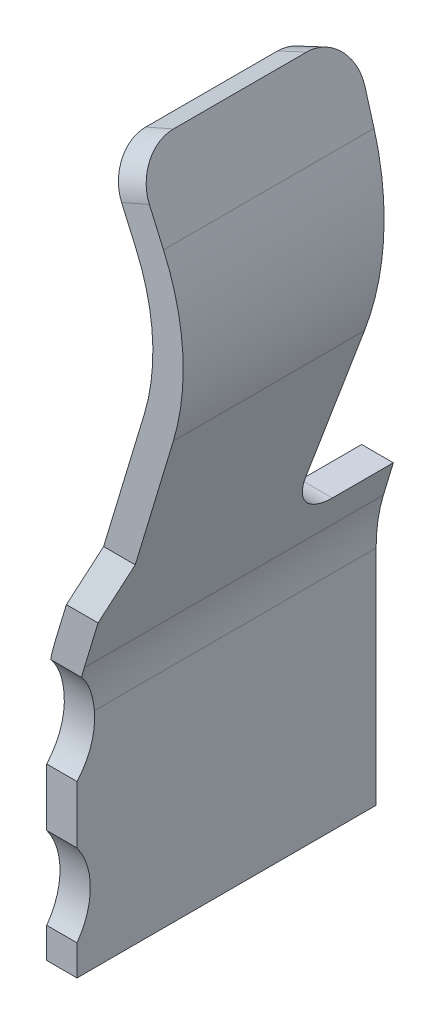
ISO-10303-21;
HEADER;
FILE_DESCRIPTION(('STEP AP214'),'2;1');
FILE_NAME('part.step','',(''),(''),'','','');
FILE_SCHEMA(('AUTOMOTIVE_DESIGN { 1 0 10303 214 1 1 1 1 }'));
ENDSEC;
DATA;
#1=APPLICATION_CONTEXT('core data for automotive mechanical design processes');
#2=APPLICATION_PROTOCOL_DEFINITION('international standard','automotive_design',2000,#1);
#3=PRODUCT_CONTEXT('',#1,'mechanical');
#4=PRODUCT('Part','Part','',(#3));
#5=PRODUCT_RELATED_PRODUCT_CATEGORY('part','',(#4));
#6=PRODUCT_DEFINITION_FORMATION('','',#4);
#7=PRODUCT_DEFINITION_CONTEXT('part definition',#1,'design');
#8=PRODUCT_DEFINITION('design','',#6,#7);
#9=PRODUCT_DEFINITION_SHAPE('','',#8);
#10=(LENGTH_UNIT() NAMED_UNIT(*) SI_UNIT(.MILLI.,.METRE.));
#11=(NAMED_UNIT(*) PLANE_ANGLE_UNIT() SI_UNIT($,.RADIAN.));
#12=(NAMED_UNIT(*) SI_UNIT($,.STERADIAN.) SOLID_ANGLE_UNIT());
#13=UNCERTAINTY_MEASURE_WITH_UNIT(LENGTH_MEASURE(1.E-05),#10,'distance_accuracy_value','');
#14=(GEOMETRIC_REPRESENTATION_CONTEXT(3) GLOBAL_UNCERTAINTY_ASSIGNED_CONTEXT((#13)) GLOBAL_UNIT_ASSIGNED_CONTEXT((#10,
#11,#12)) REPRESENTATION_CONTEXT('',''));
#15=CARTESIAN_POINT('',(0.,0.,0.));
#16=DIRECTION('',(0.,0.,1.));
#17=DIRECTION('',(1.,0.,0.));
#18=AXIS2_PLACEMENT_3D('',#15,#16,#17);
#19=CARTESIAN_POINT('',(-12.01613725867,3.53312166947706,-0.236832722369338));
#20=DIRECTION('',(-0.914255270392897,-0.402239697454475,0.0483789866630426));
#21=DIRECTION('',(0.402711251685505,-0.915327071470026,0.));
#22=AXIS2_PLACEMENT_3D('',#19,#20,#21);
#23=CYLINDRICAL_SURFACE('',#22,0.2);
#24=CARTESIAN_POINT('',(-12.0296414773253,3.50329761180303,-0.434687053017797));
#25=CARTESIAN_POINT('',(-12.0807184044719,3.6193909515076,-0.448650066039084));
#26=CARTESIAN_POINT('',(-12.1189871835182,3.70637250294574,-0.363398989614743));
#27=CARTESIAN_POINT('',(-12.1189871835182,3.70637250294574,-0.235652283248446));
#28=(BOUNDED_CURVE() B_SPLINE_CURVE(3,(#24,#25,#26,#27),.UNSPECIFIED.,.F.,
.F.) B_SPLINE_CURVE_WITH_KNOTS((4,4),(3.0320715031167,4.71238898038462),
.UNSPECIFIED.) CURVE() GEOMETRIC_REPRESENTATION_ITEM() RATIONAL_B_SPLINE_CURVE((1.,
0.778229742533871,0.778229742533871,1.)) REPRESENTATION_ITEM(''));
#29=CARTESIAN_POINT('',(-12.0296414773253,3.50329761180303,-0.434687053017797));
#30=VERTEX_POINT('',#29);
#31=CARTESIAN_POINT('',(-12.1189871835182,3.70637250294574,-0.235652283248446));
#32=VERTEX_POINT('',#31);
#33=EDGE_CURVE('E498',#30,#32,#28,.T.);
#34=ORIENTED_EDGE('',*,*,#33,.F.);
#35=DIRECTION('',(0.914255270392898,0.402239697454473,-0.0483789866630426));
#36=VECTOR('',#35,1.);
#37=CARTESIAN_POINT('',(-36.077177596038,-7.07676024092296,0.837819069551529));
#38=LINE('',#37,#36);
#39=CARTESIAN_POINT('',(-12.1669405380458,3.44289092405021,-0.427421697659669));
#40=VERTEX_POINT('',#39);
#41=EDGE_CURVE('E11',#40,#30,#38,.T.);
#42=ORIENTED_EDGE('',*,*,#41,.F.);
#43=CARTESIAN_POINT('',(-12.2562862442387,3.64596581519291,-0.228386927890318));
#44=CARTESIAN_POINT('',(-12.2562862442387,3.64596581519291,-0.356133634256616));
#45=CARTESIAN_POINT('',(-12.2180174651924,3.55898426375477,-0.441384710680957));
#46=CARTESIAN_POINT('',(-12.1669405380458,3.44289092405021,-0.427421697659669));
#47=(BOUNDED_CURVE() B_SPLINE_CURVE(3,(#43,#44,#45,#46),.UNSPECIFIED.,.F.,
.F.) B_SPLINE_CURVE_WITH_KNOTS((4,4),(1.57079632679495,3.25111380406287),
.UNSPECIFIED.) CURVE() GEOMETRIC_REPRESENTATION_ITEM() RATIONAL_B_SPLINE_CURVE((1.,
0.778229742533869,0.778229742533869,1.)) REPRESENTATION_ITEM(''));
#48=CARTESIAN_POINT('',(-12.2562862442387,3.64596581519291,-0.228386927890318));
#49=VERTEX_POINT('',#48);
#50=EDGE_CURVE('E488',#49,#40,#47,.T.);
#51=ORIENTED_EDGE('',*,*,#50,.F.);
#52=DIRECTION('',(-0.914255270392898,-0.402239697454473,0.0483789866630426));
#53=VECTOR('',#52,1.);
#54=CARTESIAN_POINT('',(-12.0966795090071,3.71618708377106,-0.236832722369339));
#55=LINE('',#54,#53);
#56=EDGE_CURVE('E522',#32,#49,#55,.T.);
#57=ORIENTED_EDGE('',*,*,#56,.F.);
#58=EDGE_LOOP('',(#34,#42,#51,#57));
#59=FACE_BOUND('',#58,.T.);
#60=ADVANCED_FACE('F16',(#59),#23,.T.);
#61=CARTESIAN_POINT('',(-12.0384449331811,3.52330708865174,0.423604352914838));
#62=DIRECTION('',(0.915327071470026,0.402711251685505,0.));
#63=DIRECTION('',(-0.402711251685505,0.915327071470026,0.));
#64=AXIS2_PLACEMENT_3D('',#61,#62,#63);
#65=CYLINDRICAL_SURFACE('',#64,0.2);
#66=CARTESIAN_POINT('',(-12.1757439939016,3.46290040089891,0.423604352914837));
#67=DIRECTION('',(-0.915327071470029,-0.402711251685498,0.));
#68=DIRECTION('',(-0.402711251685498,0.915327071470029,0.));
#69=AXIS2_PLACEMENT_3D('',#66,#67,#68);
#70=CIRCLE('',#69,0.2);
#71=CARTESIAN_POINT('',(-12.1757439939016,3.46290040089891,0.623604352914837));
#72=VERTEX_POINT('',#71);
#73=CARTESIAN_POINT('',(-12.2562862442387,3.64596581519291,0.423604352914837));
#74=VERTEX_POINT('',#73);
#75=EDGE_CURVE('E441',#72,#74,#70,.T.);
#76=ORIENTED_EDGE('',*,*,#75,.F.);
#77=DIRECTION('',(-0.915327071470027,-0.402711251685503,0.));
#78=VECTOR('',#77,1.);
#79=CARTESIAN_POINT('',(-36.7930633966531,-7.36784176638169,0.623604352914803));
#80=LINE('',#79,#78);
#81=CARTESIAN_POINT('',(-12.0384449331811,3.52330708865174,0.623604352914837));
#82=VERTEX_POINT('',#81);
#83=EDGE_CURVE('E27',#82,#72,#80,.T.);
#84=ORIENTED_EDGE('',*,*,#83,.F.);
#85=CARTESIAN_POINT('',(-12.0384449331811,3.52330708865174,0.423604352914838));
#86=DIRECTION('',(0.915327071470029,0.402711251685498,0.));
#87=DIRECTION('',(0.402711251685498,-0.915327071470029,0.));
#88=AXIS2_PLACEMENT_3D('',#85,#86,#87);
#89=CIRCLE('',#88,0.2);
#90=CARTESIAN_POINT('',(-12.1189871835182,3.70637250294574,0.423604352914837));
#91=VERTEX_POINT('',#90);
#92=EDGE_CURVE('E544',#91,#82,#89,.T.);
#93=ORIENTED_EDGE('',*,*,#92,.F.);
#94=DIRECTION('',(0.915327071470027,0.402711251685503,0.));
#95=VECTOR('',#94,1.);
#96=CARTESIAN_POINT('',(-12.1189871835182,3.70637250294574,0.423604352914837));
#97=LINE('',#96,#95);
#98=EDGE_CURVE('E516',#74,#91,#97,.T.);
#99=ORIENTED_EDGE('',*,*,#98,.F.);
#100=EDGE_LOOP('',(#76,#84,#93,#99));
#101=FACE_BOUND('',#100,.T.);
#102=ADVANCED_FACE('F301',(#101),#65,.T.);
#103=CARTESIAN_POINT('',(-40.89,1.65634067151207,-0.212546111318104));
#104=DIRECTION('',(0.,-1.,0.));
#105=DIRECTION('',(0.,0.,-1.));
#106=AXIS2_PLACEMENT_3D('',#103,#104,#105);
#107=PLANE('',#106);
#108=DIRECTION('',(0.,0.,-1.));
#109=VECTOR('',#108,1.);
#110=CARTESIAN_POINT('',(-12.3515034091056,1.65634067151207,-0.740000000000021));
#111=LINE('',#110,#109);
#112=CARTESIAN_POINT('',(-12.3515034091056,1.65634067151207,-0.438042305987955));
#113=VERTEX_POINT('',#112);
#114=CARTESIAN_POINT('',(-12.3515034091056,1.65634067151207,-0.740000000000021));
#115=VERTEX_POINT('',#114);
#116=EDGE_CURVE('E556',#113,#115,#111,.T.);
#117=ORIENTED_EDGE('',*,*,#116,.F.);
#118=DIRECTION('',(1.,0.,0.));
#119=VECTOR('',#118,1.);
#120=CARTESIAN_POINT('',(-12.1948350789415,1.65634067151207,-0.438042305987954));
#121=LINE('',#120,#119);
#122=CARTESIAN_POINT('',(-12.1948350789415,1.65634067151207,-0.438042305987954));
#123=VERTEX_POINT('',#122);
#124=EDGE_CURVE('E514',#113,#123,#121,.T.);
#125=ORIENTED_EDGE('',*,*,#124,.T.);
#126=DIRECTION('',(0.,0.,1.));
#127=VECTOR('',#126,1.);
#128=CARTESIAN_POINT('',(-12.1948350789415,1.65634067151207,-0.74000000000002));
#129=LINE('',#128,#127);
#130=CARTESIAN_POINT('',(-12.1948350789415,1.65634067151207,-0.74000000000002));
#131=VERTEX_POINT('',#130);
#132=EDGE_CURVE('E480',#131,#123,#129,.T.);
#133=ORIENTED_EDGE('',*,*,#132,.F.);
#134=DIRECTION('',(-1.,0.,0.));
#135=VECTOR('',#134,1.);
#136=CARTESIAN_POINT('',(-11.43,1.65634067151207,-0.740000000000019));
#137=LINE('',#136,#135);
#138=EDGE_CURVE('E545',#131,#115,#137,.T.);
#139=ORIENTED_EDGE('',*,*,#138,.T.);
#140=EDGE_LOOP('',(#117,#125,#133,#139));
#141=FACE_BOUND('',#140,.T.);
#142=ADVANCED_FACE('F299',(#141),#107,.F.);
#143=CARTESIAN_POINT('',(-40.89,3.70637250294571,-0.459111687165995));
#144=DIRECTION('',(0.,0.119413416546905,0.992844618230162));
#145=DIRECTION('',(1.,0.,0.));
#146=AXIS2_PLACEMENT_3D('',#143,#144,#145);
#147=PLANE('',#146);
#148=DIRECTION('',(0.286748539926818,0.951150986717315,-0.11439875574724));
#149=VECTOR('',#148,1.);
#150=CARTESIAN_POINT('',(-12.2258776351119,1.55337185451571,-0.200161637444148));
#151=LINE('',#150,#149);
#152=CARTESIAN_POINT('',(-12.1273399772696,1.88022335482146,-0.239473382341922));
#153=VERTEX_POINT('',#152);
#154=CARTESIAN_POINT('',(-11.9197982395462,2.56864369924933,-0.322272466749581));
#155=VERTEX_POINT('',#154);
#156=EDGE_CURVE('E490',#153,#155,#151,.T.);
#157=ORIENTED_EDGE('',*,*,#156,.F.);
#158=DIRECTION('',(-1.,0.,0.));
#159=VECTOR('',#158,1.);
#160=CARTESIAN_POINT('',(-12.3515034091056,1.88022335482146,-0.239473382341922));
#161=LINE('',#160,#159);
#162=CARTESIAN_POINT('',(-12.2840083074336,1.88022335482146,-0.239473382341922));
#163=VERTEX_POINT('',#162);
#164=EDGE_CURVE('E376',#153,#163,#161,.T.);
#165=ORIENTED_EDGE('',*,*,#164,.T.);
#166=DIRECTION('',(-0.28674853992682,-0.951150986717314,0.11439875574724));
#167=VECTOR('',#166,1.);
#168=CARTESIAN_POINT('',(-12.3696639548885,1.59610175610151,-0.205300934614505));
#169=LINE('',#168,#167);
#170=CARTESIAN_POINT('',(-12.0634137359037,2.61194022573825,-0.327479914176623));
#171=VERTEX_POINT('',#170);
#172=EDGE_CURVE('E560',#171,#163,#169,.T.);
#173=ORIENTED_EDGE('',*,*,#172,.F.);
#174=CARTESIAN_POINT('',(-12.1055233068166,3.30329498734983,-0.410631932744419));
#175=CARTESIAN_POINT('',(-12.0085450102924,3.08287189317973,-0.384120760424612));
#176=CARTESIAN_POINT('',(-11.9939044888234,2.84250387207174,-0.355210731501567));
#177=CARTESIAN_POINT('',(-12.0634137359037,2.61194022573825,-0.327479914176623));
#178=(BOUNDED_CURVE() B_SPLINE_CURVE(3,(#174,#175,#176,#177),.UNSPECIFIED.,.F.,
.F.) B_SPLINE_CURVE_WITH_KNOTS((4,4),(4.29791199977039,5.00519872138853),
.UNSPECIFIED.) CURVE() GEOMETRIC_REPRESENTATION_ITEM() RATIONAL_B_SPLINE_CURVE((1.,
0.958744787021091,0.958744787021091,1.)) REPRESENTATION_ITEM(''));
#179=CARTESIAN_POINT('',(-12.1055233068166,3.30329498734983,-0.410631932744419));
#180=VERTEX_POINT('',#179);
#181=EDGE_CURVE('E443',#180,#171,#178,.T.);
#182=ORIENTED_EDGE('',*,*,#181,.F.);
#183=DIRECTION('',(0.400292818236851,-0.909830186054405,0.109428936813833));
#184=VECTOR('',#183,1.);
#185=CARTESIAN_POINT('',(-12.1199508196559,3.33608744850051,-0.414576013974334));
#186=LINE('',#185,#184);
#187=EDGE_CURVE('E486',#40,#180,#186,.T.);
#188=ORIENTED_EDGE('',*,*,#187,.F.);
#189=ORIENTED_EDGE('',*,*,#41,.T.);
#190=DIRECTION('',(-0.40029281823685,0.909830186054405,-0.109428936813833));
#191=VECTOR('',#190,1.);
#192=CARTESIAN_POINT('',(-11.9823335100882,3.39577078475993,-0.421754368938235));
#193=LINE('',#192,#191);
#194=CARTESIAN_POINT('',(-11.9682242460961,3.36370167510267,-0.417897288102547));
#195=VERTEX_POINT('',#194);
#196=EDGE_CURVE('E505',#195,#30,#193,.T.);
#197=ORIENTED_EDGE('',*,*,#196,.F.);
#198=CARTESIAN_POINT('',(-11.9197982395462,2.56864369924933,-0.322272466749581));
#199=CARTESIAN_POINT('',(-11.839862605404,2.83379189253285,-0.354162906673267));
#200=CARTESIAN_POINT('',(-11.8566992050933,3.11021511680704,-0.387409439934769));
#201=CARTESIAN_POINT('',(-11.9682242460961,3.36370167510267,-0.417897288102547));
#202=(BOUNDED_CURVE() B_SPLINE_CURVE(3,(#198,#199,#200,#201),.UNSPECIFIED.,.F.,
.F.) B_SPLINE_CURVE_WITH_KNOTS((4,4),(1.27798658579106,1.98527330740919),
.UNSPECIFIED.) CURVE() GEOMETRIC_REPRESENTATION_ITEM() RATIONAL_B_SPLINE_CURVE((1.,
0.958744787021091,0.958744787021091,1.)) REPRESENTATION_ITEM(''));
#203=EDGE_CURVE('E266',#155,#195,#202,.T.);
#204=ORIENTED_EDGE('',*,*,#203,.F.);
#205=EDGE_LOOP('',(#157,#165,#173,#182,#188,#189,#197,#204));
#206=FACE_BOUND('',#205,.T.);
#207=ADVANCED_FACE('F351',(#206),#147,.F.);
#208=CARTESIAN_POINT('',(-40.89,1.94413292378283,0.623604352914797));
#209=DIRECTION('',(0.,0.,-1.));
#210=DIRECTION('',(0.,-1.,0.));
#211=AXIS2_PLACEMENT_3D('',#208,#209,#210);
#212=PLANE('',#211);
#213=DIRECTION('',(0.4027112516855,-0.915327071470028,0.));
#214=VECTOR('',#213,1.);
#215=CARTESIAN_POINT('',(-11.9682242460961,3.36370167510267,0.623604352914838));
#216=LINE('',#215,#214);
#217=CARTESIAN_POINT('',(-11.9682242460961,3.36370167510267,0.623604352914838));
#218=VERTEX_POINT('',#217);
#219=EDGE_CURVE('E541',#82,#218,#216,.T.);
#220=ORIENTED_EDGE('',*,*,#219,.F.);
#221=ORIENTED_EDGE('',*,*,#83,.T.);
#222=DIRECTION('',(-0.402711251685501,0.915327071470028,0.));
#223=VECTOR('',#222,1.);
#224=CARTESIAN_POINT('',(-12.1055233068166,3.30329498734984,0.623604352914837));
#225=LINE('',#224,#223);
#226=CARTESIAN_POINT('',(-12.1055233068166,3.30329498734983,0.623604352914837));
#227=VERTEX_POINT('',#226);
#228=EDGE_CURVE('E536',#227,#72,#225,.T.);
#229=ORIENTED_EDGE('',*,*,#228,.F.);
#230=CARTESIAN_POINT('',(-13.0208503782866,2.90058373566433,0.623604352914836));
#231=DIRECTION('',(0.,0.,1.));
#232=DIRECTION('',(-1.,0.,0.));
#233=AXIS2_PLACEMENT_3D('',#230,#231,#232);
#234=CIRCLE('',#233,1.);
#235=CARTESIAN_POINT('',(-12.0634137359037,2.61194022573825,0.623604352914837));
#236=VERTEX_POINT('',#235);
#237=EDGE_CURVE('E539',#236,#227,#234,.T.);
#238=ORIENTED_EDGE('',*,*,#237,.F.);
#239=DIRECTION('',(0.28864350992609,0.957436642382956,0.));
#240=VECTOR('',#239,1.);
#241=CARTESIAN_POINT('',(-12.387436642383,1.53714937485737,0.623604352914836));
#242=LINE('',#241,#240);
#243=CARTESIAN_POINT('',(-12.2647411502284,1.94413292378283,0.623604352914837));
#244=VERTEX_POINT('',#243);
#245=EDGE_CURVE('E368',#244,#236,#242,.T.);
#246=ORIENTED_EDGE('',*,*,#245,.F.);
#247=DIRECTION('',(1.,0.,0.));
#248=VECTOR('',#247,1.);
#249=CARTESIAN_POINT('',(-40.89,1.94413292378283,0.623604352914797));
#250=LINE('',#249,#248);
#251=CARTESIAN_POINT('',(-12.1080728200643,1.94413292378283,0.623604352914837));
#252=VERTEX_POINT('',#251);
#253=EDGE_CURVE('E454',#244,#252,#250,.T.);
#254=ORIENTED_EDGE('',*,*,#253,.T.);
#255=DIRECTION('',(-0.288643509926088,-0.957436642382956,0.));
#256=VECTOR('',#255,1.);
#257=CARTESIAN_POINT('',(-12.2438211460255,1.49385284836845,0.623604352914837));
#258=LINE('',#257,#256);
#259=CARTESIAN_POINT('',(-11.9197982395462,2.56864369924933,0.623604352914837));
#260=VERTEX_POINT('',#259);
#261=EDGE_CURVE('E532',#260,#252,#258,.T.);
#262=ORIENTED_EDGE('',*,*,#261,.F.);
#263=CARTESIAN_POINT('',(-13.0208503782866,2.90058373566433,0.623604352914836));
#264=DIRECTION('',(0.,0.,-1.));
#265=DIRECTION('',(-1.,0.,0.));
#266=AXIS2_PLACEMENT_3D('',#263,#264,#265);
#267=CIRCLE('',#266,1.15);
#268=EDGE_CURVE('E575',#218,#260,#267,.T.);
#269=ORIENTED_EDGE('',*,*,#268,.F.);
#270=EDGE_LOOP('',(#220,#221,#229,#238,#246,#254,#262,#269));
#271=FACE_BOUND('',#270,.T.);
#272=ADVANCED_FACE('F661',(#271),#212,.F.);
#273=CARTESIAN_POINT('',(-40.89,1.7003498353216,0.749999999999972));
#274=DIRECTION('',(0.,-0.460287319631494,-0.887770005906065));
#275=DIRECTION('',(0.,-0.887770005906065,0.460287319631494));
#276=AXIS2_PLACEMENT_3D('',#273,#274,#275);
#277=PLANE('',#276);
#278=ORIENTED_EDGE('',*,*,#253,.F.);
#279=DIRECTION('',(0.258541028225373,0.857586072334425,-0.444637678635293));
#280=VECTOR('',#279,1.);
#281=CARTESIAN_POINT('',(-12.2064234383064,2.13757401070795,0.523309818502746));
#282=LINE('',#281,#280);
#283=CARTESIAN_POINT('',(-12.3324210876793,1.7196371362757,0.73999999999998));
#284=VERTEX_POINT('',#283);
#285=EDGE_CURVE('E482',#284,#244,#282,.T.);
#286=ORIENTED_EDGE('',*,*,#285,.F.);
#287=DIRECTION('',(-1.,0.,0.));
#288=VECTOR('',#287,1.);
#289=CARTESIAN_POINT('',(-11.43,1.7196371362757,0.739999999999981));
#290=LINE('',#289,#288);
#291=CARTESIAN_POINT('',(-12.1757527575152,1.7196371362757,0.73999999999998));
#292=VERTEX_POINT('',#291);
#293=EDGE_CURVE('E525',#292,#284,#290,.T.);
#294=ORIENTED_EDGE('',*,*,#293,.F.);
#295=DIRECTION('',(-0.258541028225372,-0.857586072334425,0.444637678635293));
#296=VECTOR('',#295,1.);
#297=CARTESIAN_POINT('',(-12.0602273619162,2.10283732290249,0.541319952677682));
#298=LINE('',#297,#296);
#299=EDGE_CURVE('E272',#252,#292,#298,.T.);
#300=ORIENTED_EDGE('',*,*,#299,.F.);
#301=EDGE_LOOP('',(#278,#286,#294,#300));
#302=FACE_BOUND('',#301,.T.);
#303=ADVANCED_FACE('F653',(#302),#277,.F.);
#304=CARTESIAN_POINT('',(-11.43,1.24850586493128,0.739999999999981));
#305=DIRECTION('',(0.,0.,-1.));
#306=DIRECTION('',(0.,-1.,0.));
#307=AXIS2_PLACEMENT_3D('',#304,#305,#306);
#308=PLANE('',#307);
#309=DIRECTION('',(0.,1.,0.));
#310=VECTOR('',#309,1.);
#311=CARTESIAN_POINT('',(-12.28,0.145965815192914,0.73999999999998));
#312=LINE('',#311,#310);
#313=CARTESIAN_POINT('',(-12.28,0.145965815192914,0.73999999999998));
#314=VERTEX_POINT('',#313);
#315=CARTESIAN_POINT('',(-12.28,0.296740599868486,0.73999999999998));
#316=VERTEX_POINT('',#315);
#317=EDGE_CURVE('E414',#314,#316,#312,.T.);
#318=ORIENTED_EDGE('',*,*,#317,.T.);
#319=DIRECTION('',(-1.,0.,0.));
#320=VECTOR('',#319,1.);
#321=CARTESIAN_POINT('',(-40.89,0.296740599868486,0.73999999999994));
#322=LINE('',#321,#320);
#323=CARTESIAN_POINT('',(-12.43,0.296740599868486,0.739999999999979));
#324=VERTEX_POINT('',#323);
#325=EDGE_CURVE('E253',#316,#324,#322,.T.);
#326=ORIENTED_EDGE('',*,*,#325,.T.);
#327=DIRECTION('',(0.,-1.,0.));
#328=VECTOR('',#327,1.);
#329=CARTESIAN_POINT('',(-12.43,0.145965815192914,0.739999999999979));
#330=LINE('',#329,#328);
#331=CARTESIAN_POINT('',(-12.43,0.145965815192914,0.739999999999979));
#332=VERTEX_POINT('',#331);
#333=EDGE_CURVE('E548',#324,#332,#330,.T.);
#334=ORIENTED_EDGE('',*,*,#333,.T.);
#335=DIRECTION('',(1.,0.,0.));
#336=VECTOR('',#335,1.);
#337=CARTESIAN_POINT('',(-12.28,0.145965815192914,0.73999999999998));
#338=LINE('',#337,#336);
#339=EDGE_CURVE('E457',#332,#314,#338,.T.);
#340=ORIENTED_EDGE('',*,*,#339,.T.);
#341=EDGE_LOOP('',(#318,#326,#334,#340));
#342=FACE_BOUND('',#341,.T.);
#343=ADVANCED_FACE('F651',(#342),#308,.F.);
#344=CARTESIAN_POINT('',(-11.43,1.24850586493128,-0.740000000000019));
#345=DIRECTION('',(0.,0.,-1.));
#346=DIRECTION('',(0.,-1.,0.));
#347=AXIS2_PLACEMENT_3D('',#344,#345,#346);
#348=PLANE('',#347);
#349=ORIENTED_EDGE('',*,*,#138,.F.);
#350=DIRECTION('',(0.288643509926088,0.957436642382956,0.));
#351=VECTOR('',#350,1.);
#352=CARTESIAN_POINT('',(-12.2438211460255,1.49385284836845,-0.74000000000002));
#353=LINE('',#352,#351);
#354=CARTESIAN_POINT('',(-12.2438211460255,1.49385284836845,-0.74000000000002));
#355=VERTEX_POINT('',#354);
#356=EDGE_CURVE('E477',#355,#131,#353,.T.);
#357=ORIENTED_EDGE('',*,*,#356,.F.);
#358=CARTESIAN_POINT('',(-11.43,1.24850586493128,-0.740000000000019));
#359=DIRECTION('',(0.,0.,-1.));
#360=DIRECTION('',(1.,0.,0.));
#361=AXIS2_PLACEMENT_3D('',#358,#359,#360);
#362=CIRCLE('',#361,0.85);
#363=CARTESIAN_POINT('',(-12.28,1.24850586493128,-0.74000000000002));
#364=VERTEX_POINT('',#363);
#365=EDGE_CURVE('E497',#364,#355,#362,.T.);
#366=ORIENTED_EDGE('',*,*,#365,.F.);
#367=DIRECTION('',(0.,1.,0.));
#368=VECTOR('',#367,1.);
#369=CARTESIAN_POINT('',(-12.28,0.145965815192914,-0.74000000000002));
#370=LINE('',#369,#368);
#371=CARTESIAN_POINT('',(-12.28,0.145965815192914,-0.74000000000002));
#372=VERTEX_POINT('',#371);
#373=EDGE_CURVE('E422',#372,#364,#370,.T.);
#374=ORIENTED_EDGE('',*,*,#373,.F.);
#375=DIRECTION('',(1.,0.,0.));
#376=VECTOR('',#375,1.);
#377=CARTESIAN_POINT('',(-12.28,0.145965815192914,-0.74000000000002));
#378=LINE('',#377,#376);
#379=CARTESIAN_POINT('',(-12.43,0.145965815192914,-0.740000000000021));
#380=VERTEX_POINT('',#379);
#381=EDGE_CURVE('E426',#380,#372,#378,.T.);
#382=ORIENTED_EDGE('',*,*,#381,.F.);
#383=DIRECTION('',(0.,-1.,0.));
#384=VECTOR('',#383,1.);
#385=CARTESIAN_POINT('',(-12.43,0.145965815192914,-0.740000000000021));
#386=LINE('',#385,#384);
#387=CARTESIAN_POINT('',(-12.43,1.24850586493128,-0.740000000000021));
#388=VERTEX_POINT('',#387);
#389=EDGE_CURVE('E42',#388,#380,#386,.T.);
#390=ORIENTED_EDGE('',*,*,#389,.F.);
#391=CARTESIAN_POINT('',(-11.43,1.24850586493128,-0.740000000000019));
#392=DIRECTION('',(0.,0.,1.));
#393=DIRECTION('',(1.,0.,0.));
#394=AXIS2_PLACEMENT_3D('',#391,#392,#393);
#395=CIRCLE('',#394,1.);
#396=CARTESIAN_POINT('',(-12.387436642383,1.53714937485737,-0.740000000000021));
#397=VERTEX_POINT('',#396);
#398=EDGE_CURVE('E367',#397,#388,#395,.T.);
#399=ORIENTED_EDGE('',*,*,#398,.F.);
#400=DIRECTION('',(-0.28864350992609,-0.957436642382956,0.));
#401=VECTOR('',#400,1.);
#402=CARTESIAN_POINT('',(-12.387436642383,1.53714937485737,-0.740000000000021));
#403=LINE('',#402,#401);
#404=EDGE_CURVE('E559',#115,#397,#403,.T.);
#405=ORIENTED_EDGE('',*,*,#404,.F.);
#406=EDGE_LOOP('',(#349,#357,#366,#374,#382,#390,#399,#405));
#407=FACE_BOUND('',#406,.T.);
#408=ADVANCED_FACE('F650',(#407),#348,.T.);
#409=CARTESIAN_POINT('',(-12.43,0.145965815192914,-0.740000000000021));
#410=DIRECTION('',(1.,0.,0.));
#411=DIRECTION('',(0.,1.,0.));
#412=AXIS2_PLACEMENT_3D('',#409,#410,#411);
#413=PLANE('',#412);
#414=DIRECTION('',(0.,-1.,0.));
#415=VECTOR('',#414,1.);
#416=CARTESIAN_POINT('',(-12.43,0.145965815192914,0.739999999999979));
#417=LINE('',#416,#415);
#418=CARTESIAN_POINT('',(-12.43,0.988055123608201,0.739999999999979));
#419=VERTEX_POINT('',#418);
#420=CARTESIAN_POINT('',(-12.43,0.703259400131467,0.739999999999979));
#421=VERTEX_POINT('',#420);
#422=EDGE_CURVE('E239',#419,#421,#417,.T.);
#423=ORIENTED_EDGE('',*,*,#422,.F.);
#424=CARTESIAN_POINT('',(-12.43,1.21669179396546,0.995153761033096));
#425=DIRECTION('',(1.,0.,0.));
#426=DIRECTION('',(0.,1.,0.));
#427=AXIS2_PLACEMENT_3D('',#424,#425,#426);
#428=CIRCLE('',#427,0.342604974863759);
#429=CARTESIAN_POINT('',(-12.43,1.24850586493128,0.654029100989324));
#430=VERTEX_POINT('',#429);
#431=EDGE_CURVE('E371',#419,#430,#428,.T.);
#432=ORIENTED_EDGE('',*,*,#431,.T.);
#433=DIRECTION('',(0.,0.,1.));
#434=VECTOR('',#433,1.);
#435=CARTESIAN_POINT('',(-12.43,1.24850586493128,-0.740000000000021));
#436=LINE('',#435,#434);
#437=EDGE_CURVE('E359',#388,#430,#436,.T.);
#438=ORIENTED_EDGE('',*,*,#437,.F.);
#439=ORIENTED_EDGE('',*,*,#389,.T.);
#440=DIRECTION('',(0.,0.,1.));
#441=VECTOR('',#440,1.);
#442=CARTESIAN_POINT('',(-12.43,0.145965815192914,-0.740000000000021));
#443=LINE('',#442,#441);
#444=EDGE_CURVE('E437',#380,#332,#443,.T.);
#445=ORIENTED_EDGE('',*,*,#444,.T.);
#446=ORIENTED_EDGE('',*,*,#333,.F.);
#447=CARTESIAN_POINT('',(-12.43,0.499999999999977,1.0194268345702));
#448=DIRECTION('',(1.,0.,0.));
#449=DIRECTION('',(0.,1.,0.));
#450=AXIS2_PLACEMENT_3D('',#447,#448,#449);
#451=CIRCLE('',#450,0.345533991988848);
#452=EDGE_CURVE('E261',#324,#421,#451,.T.);
#453=ORIENTED_EDGE('',*,*,#452,.T.);
#454=EDGE_LOOP('',(#423,#432,#438,#439,#445,#446,#453));
#455=FACE_BOUND('',#454,.T.);
#456=ADVANCED_FACE('F18',(#455),#413,.F.);
#457=CARTESIAN_POINT('',(-11.43,1.24850586493128,-0.740000000000019));
#458=DIRECTION('',(0.,0.,1.));
#459=DIRECTION('',(-1.,0.,0.));
#460=AXIS2_PLACEMENT_3D('',#457,#458,#459);
#461=CYLINDRICAL_SURFACE('',#460,1.);
#462=ORIENTED_EDGE('',*,*,#437,.T.);
#463=CARTESIAN_POINT('',(-12.43,1.24850586493127,0.654029100989324));
#464=CARTESIAN_POINT('',(-12.4300000740736,1.25306932177769,0.654454497923855));
#465=CARTESIAN_POINT('',(-12.4299687647214,1.25762446546754,0.654969794425812));
#466=CARTESIAN_POINT('',(-12.4298448349043,1.26669234380949,0.656178662703579));
#467=CARTESIAN_POINT('',(-12.429752450797,1.27120517419934,0.656871540938648));
#468=CARTESIAN_POINT('',(-12.4295080867067,1.28018764830172,0.658435530000208));
#469=CARTESIAN_POINT('',(-12.4293562428961,1.28465736695006,0.659306231418308));
#470=CARTESIAN_POINT('',(-12.428994777031,1.29355289226591,0.66122551469751));
#471=CARTESIAN_POINT('',(-12.428785194459,1.29797872680704,0.662273974817246));
#472=CARTESIAN_POINT('',(-12.428310027927,1.30678583476538,0.664548502475913));
#473=CARTESIAN_POINT('',(-12.4280443925259,1.31116706334832,0.665774732832877));
#474=CARTESIAN_POINT('',(-12.4274588915287,1.3198843749952,0.668404514864961));
#475=CARTESIAN_POINT('',(-12.4271388909945,1.32422031651455,0.669808505489047));
#476=CARTESIAN_POINT('',(-12.4264464106962,1.33284654509366,0.672793524574377));
#477=CARTESIAN_POINT('',(-12.426073721373,1.33713657245192,0.674375254537423));
#478=CARTESIAN_POINT('',(-12.4252776024185,1.3456704905919,0.677715533217602));
#479=CARTESIAN_POINT('',(-12.424853898673,1.34991398511775,0.679475028174317));
#480=CARTESIAN_POINT('',(-12.4239632184939,1.3583001952392,0.683146652073635));
#481=CARTESIAN_POINT('',(-12.4234965071955,1.36244335249474,0.685057836907787));
#482=CARTESIAN_POINT('',(-12.4225231286019,1.37063194178133,0.689033531510635));
#483=CARTESIAN_POINT('',(-12.4220166121165,1.3746776733672,0.691097460992988));
#484=CARTESIAN_POINT('',(-12.4209671316822,1.38267128376321,0.695378434356097));
#485=CARTESIAN_POINT('',(-12.4204242473525,1.38661935199285,0.697595144047742));
#486=CARTESIAN_POINT('',(-12.4193054429821,1.3944176464863,0.702181418875124));
#487=CARTESIAN_POINT('',(-12.4187295429942,1.39826793013338,0.704550891333563));
#488=CARTESIAN_POINT('',(-12.4175480296279,1.40587073759801,0.709442454925419));
#489=CARTESIAN_POINT('',(-12.4169423891827,1.40962316742021,0.711964685589659));
#490=CARTESIAN_POINT('',(-12.4157046207362,1.41703045047604,0.717161525964015));
#491=CARTESIAN_POINT('',(-12.4150724314729,1.42068504210867,0.71983649388048));
#492=CARTESIAN_POINT('',(-12.4137847065421,1.42789683764646,0.725338623348415));
#493=CARTESIAN_POINT('',(-12.4131290884706,1.43145359950904,0.728166344681736));
#494=CARTESIAN_POINT('',(-12.4117975159457,1.43847023753003,0.733973670299635));
#495=CARTESIAN_POINT('',(-12.4111214705009,1.44192948379841,0.736954014976292));
#496=CARTESIAN_POINT('',(-12.4104391181347,1.44532846432271,0.73999999999998));
#497=B_SPLINE_CURVE_WITH_KNOTS('',3,(#463,#464,#465,#466,#467,#468,#469,#470,#471,#472,#473,
#474,#475,#476,#477,#478,#479,#480,#481,#482,#483,#484,#485,#486,#487,#488,#489,#490,#491,#492,
#493,#494,#495,#496),.UNSPECIFIED.,.F.,.F.,(4,2,2,2,2,2,2,2,2,2,2,2,2,2,2,2,4),(0.,
0.0137488277368624,0.0274447569678338,0.0411095020482752,0.0547649260999381,0.0684329369758103,
0.0821353821583741,0.0958939450962579,0.109730045405106,0.123485924963603,0.13719199135644,
0.150868974600578,0.164537737054553,0.178219178701913,0.191934141579245,0.205703315520567,
0.219547147320745),.UNSPECIFIED.);
#498=CARTESIAN_POINT('',(-12.4104391181347,1.44532846432271,0.739999999999979));
#499=VERTEX_POINT('',#498);
#500=EDGE_CURVE('E281',#430,#499,#497,.T.);
#501=ORIENTED_EDGE('',*,*,#500,.T.);
#502=CARTESIAN_POINT('',(-11.43,1.24850586493128,0.739999999999981));
#503=DIRECTION('',(0.,0.,1.));
#504=DIRECTION('',(1.,0.,0.));
#505=AXIS2_PLACEMENT_3D('',#502,#503,#504);
#506=CIRCLE('',#505,1.);
#507=CARTESIAN_POINT('',(-12.387436642383,1.53714937485737,0.739999999999979));
#508=VERTEX_POINT('',#507);
#509=EDGE_CURVE('E379',#508,#499,#506,.T.);
#510=ORIENTED_EDGE('',*,*,#509,.F.);
#511=DIRECTION('',(0.,0.,1.));
#512=VECTOR('',#511,1.);
#513=CARTESIAN_POINT('',(-12.387436642383,1.53714937485737,-0.740000000000021));
#514=LINE('',#513,#512);
#515=EDGE_CURVE('E485',#397,#508,#514,.T.);
#516=ORIENTED_EDGE('',*,*,#515,.F.);
#517=ORIENTED_EDGE('',*,*,#398,.T.);
#518=EDGE_LOOP('',(#462,#501,#510,#516,#517));
#519=FACE_BOUND('',#518,.T.);
#520=ADVANCED_FACE('F288',(#519),#461,.T.);
#521=CARTESIAN_POINT('',(-12.387436642383,1.53714937485737,-0.740000000000021));
#522=DIRECTION('',(0.957436642382956,-0.28864350992609,0.));
#523=DIRECTION('',(0.,0.,-1.));
#524=AXIS2_PLACEMENT_3D('',#521,#522,#523);
#525=PLANE('',#524);
#526=ORIENTED_EDGE('',*,*,#172,.T.);
#527=CARTESIAN_POINT('',(-12.2840083074336,1.88022335482146,-0.239473382341922));
#528=CARTESIAN_POINT('',(-12.2863982742986,1.87229578405696,-0.238519901512672));
#529=CARTESIAN_POINT('',(-12.2888011555845,1.86432537588468,-0.238042305987954));
#530=CARTESIAN_POINT('',(-12.2912083468218,1.85634067151208,-0.238042305987954));
#531=(BOUNDED_CURVE() B_SPLINE_CURVE(3,(#527,#528,#529,#530),.UNSPECIFIED.,.F.,
.F.) B_SPLINE_CURVE_WITH_KNOTS((4,4),(4.59268992994791,4.71238898038469),
.UNSPECIFIED.) CURVE() GEOMETRIC_REPRESENTATION_ITEM() RATIONAL_B_SPLINE_CURVE((1.,
0.998806367803328,0.998806367803328,1.)) REPRESENTATION_ITEM(''));
#532=CARTESIAN_POINT('',(-12.2912083468218,1.85634067151208,-0.238042305987954));
#533=VERTEX_POINT('',#532);
#534=EDGE_CURVE('E565',#163,#533,#531,.T.);
#535=ORIENTED_EDGE('',*,*,#534,.T.);
#536=CARTESIAN_POINT('',(-12.2912083468218,1.85634067151208,-0.238042305987954));
#537=CARTESIAN_POINT('',(-12.3265283765635,1.73918338398669,-0.238042305987954));
#538=CARTESIAN_POINT('',(-12.3515034091056,1.65634067151208,-0.320885018462573));
#539=CARTESIAN_POINT('',(-12.3515034091056,1.65634067151207,-0.438042305987955));
#540=(BOUNDED_CURVE() B_SPLINE_CURVE(3,(#536,#537,#538,#539),.UNSPECIFIED.,.F.,
.F.) B_SPLINE_CURVE_WITH_KNOTS((4,4),(4.71238898038469,6.28318530717959),
.UNSPECIFIED.) CURVE() GEOMETRIC_REPRESENTATION_ITEM() RATIONAL_B_SPLINE_CURVE((1.,
0.804737854124365,0.804737854124365,1.)) REPRESENTATION_ITEM(''));
#541=EDGE_CURVE('E473',#533,#113,#540,.T.);
#542=ORIENTED_EDGE('',*,*,#541,.T.);
#543=ORIENTED_EDGE('',*,*,#116,.T.);
#544=ORIENTED_EDGE('',*,*,#404,.T.);
#545=ORIENTED_EDGE('',*,*,#515,.T.);
#546=DIRECTION('',(-0.28864350992609,-0.957436642382956,0.));
#547=VECTOR('',#546,1.);
#548=CARTESIAN_POINT('',(-12.387436642383,1.53714937485737,0.739999999999979));
#549=LINE('',#548,#547);
#550=EDGE_CURVE('E382',#284,#508,#549,.T.);
#551=ORIENTED_EDGE('',*,*,#550,.F.);
#552=ORIENTED_EDGE('',*,*,#285,.T.);
#553=ORIENTED_EDGE('',*,*,#245,.T.);
#554=DIRECTION('',(0.,0.,1.));
#555=VECTOR('',#554,1.);
#556=CARTESIAN_POINT('',(-12.0634137359037,2.61194022573825,-0.74000000000002));
#557=LINE('',#556,#555);
#558=EDGE_CURVE('E448',#171,#236,#557,.T.);
#559=ORIENTED_EDGE('',*,*,#558,.F.);
#560=EDGE_LOOP('',(#526,#535,#542,#543,#544,#545,#551,#552,#553,#559));
#561=FACE_BOUND('',#560,.T.);
#562=ADVANCED_FACE('F298',(#561),#525,.F.);
#563=CARTESIAN_POINT('',(-13.0208503782866,2.90058373566433,-0.740000000000021));
#564=DIRECTION('',(0.,0.,1.));
#565=DIRECTION('',(-1.,0.,0.));
#566=AXIS2_PLACEMENT_3D('',#563,#564,#565);
#567=CYLINDRICAL_SURFACE('',#566,1.);
#568=DIRECTION('',(0.,0.,1.));
#569=VECTOR('',#568,1.);
#570=CARTESIAN_POINT('',(-12.1055233068166,3.30329498734983,-0.74000000000002));
#571=LINE('',#570,#569);
#572=EDGE_CURVE('E449',#180,#227,#571,.T.);
#573=ORIENTED_EDGE('',*,*,#572,.F.);
#574=ORIENTED_EDGE('',*,*,#181,.T.);
#575=ORIENTED_EDGE('',*,*,#558,.T.);
#576=ORIENTED_EDGE('',*,*,#237,.T.);
#577=EDGE_LOOP('',(#573,#574,#575,#576));
#578=FACE_BOUND('',#577,.T.);
#579=ADVANCED_FACE('F688',(#578),#567,.F.);
#580=CARTESIAN_POINT('',(-12.1055233068166,3.30329498734984,-0.74000000000002));
#581=DIRECTION('',(0.915327071470028,0.402711251685501,0.));
#582=DIRECTION('',(0.,0.,-1.));
#583=AXIS2_PLACEMENT_3D('',#580,#581,#582);
#584=PLANE('',#583);
#585=ORIENTED_EDGE('',*,*,#228,.T.);
#586=ORIENTED_EDGE('',*,*,#75,.T.);
#587=DIRECTION('',(0.,0.,1.));
#588=VECTOR('',#587,1.);
#589=CARTESIAN_POINT('',(-12.2562862442387,3.64596581519291,-0.740000000000021));
#590=LINE('',#589,#588);
#591=EDGE_CURVE('E504',#49,#74,#590,.T.);
#592=ORIENTED_EDGE('',*,*,#591,.F.);
#593=ORIENTED_EDGE('',*,*,#50,.T.);
#594=ORIENTED_EDGE('',*,*,#187,.T.);
#595=ORIENTED_EDGE('',*,*,#572,.T.);
#596=EDGE_LOOP('',(#585,#586,#592,#593,#594,#595));
#597=FACE_BOUND('',#596,.T.);
#598=ADVANCED_FACE('F685',(#597),#584,.F.);
#599=CARTESIAN_POINT('',(-12.1189871835182,3.70637250294574,-0.74000000000002));
#600=DIRECTION('',(0.402711251685503,-0.915327071470027,0.));
#601=DIRECTION('',(0.,0.,-1.));
#602=AXIS2_PLACEMENT_3D('',#599,#600,#601);
#603=PLANE('',#602);
#604=ORIENTED_EDGE('',*,*,#591,.T.);
#605=ORIENTED_EDGE('',*,*,#98,.T.);
#606=DIRECTION('',(0.,0.,1.));
#607=VECTOR('',#606,1.);
#608=CARTESIAN_POINT('',(-12.1189871835182,3.70637250294574,-0.74000000000002));
#609=LINE('',#608,#607);
#610=EDGE_CURVE('E586',#32,#91,#609,.T.);
#611=ORIENTED_EDGE('',*,*,#610,.F.);
#612=ORIENTED_EDGE('',*,*,#56,.T.);
#613=EDGE_LOOP('',(#604,#605,#611,#612));
#614=FACE_BOUND('',#613,.T.);
#615=ADVANCED_FACE('F682',(#614),#603,.F.);
#616=CARTESIAN_POINT('',(-11.9682242460961,3.36370167510267,-0.74000000000002));
#617=DIRECTION('',(-0.915327071470028,-0.4027112516855,0.));
#618=DIRECTION('',(-0.4027112516855,0.915327071470028,0.));
#619=AXIS2_PLACEMENT_3D('',#616,#617,#618);
#620=PLANE('',#619);
#621=ORIENTED_EDGE('',*,*,#610,.T.);
#622=ORIENTED_EDGE('',*,*,#92,.T.);
#623=ORIENTED_EDGE('',*,*,#219,.T.);
#624=DIRECTION('',(0.,0.,1.));
#625=VECTOR('',#624,1.);
#626=CARTESIAN_POINT('',(-11.9682242460961,3.36370167510267,-0.74000000000002));
#627=LINE('',#626,#625);
#628=EDGE_CURVE('E271',#195,#218,#627,.T.);
#629=ORIENTED_EDGE('',*,*,#628,.F.);
#630=ORIENTED_EDGE('',*,*,#196,.T.);
#631=ORIENTED_EDGE('',*,*,#33,.T.);
#632=EDGE_LOOP('',(#621,#622,#623,#629,#630,#631));
#633=FACE_BOUND('',#632,.T.);
#634=ADVANCED_FACE('F684',(#633),#620,.F.);
#635=CARTESIAN_POINT('',(-13.0208503782866,2.90058373566433,-0.740000000000021));
#636=DIRECTION('',(0.,0.,1.));
#637=DIRECTION('',(-1.,0.,0.));
#638=AXIS2_PLACEMENT_3D('',#635,#636,#637);
#639=CYLINDRICAL_SURFACE('',#638,1.15);
#640=DIRECTION('',(0.,0.,1.));
#641=VECTOR('',#640,1.);
#642=CARTESIAN_POINT('',(-11.9197982395462,2.56864369924933,-0.74000000000002));
#643=LINE('',#642,#641);
#644=EDGE_CURVE('E494',#155,#260,#643,.T.);
#645=ORIENTED_EDGE('',*,*,#644,.F.);
#646=ORIENTED_EDGE('',*,*,#203,.T.);
#647=ORIENTED_EDGE('',*,*,#628,.T.);
#648=ORIENTED_EDGE('',*,*,#268,.T.);
#649=EDGE_LOOP('',(#645,#646,#647,#648));
#650=FACE_BOUND('',#649,.T.);
#651=ADVANCED_FACE('F317',(#650),#639,.T.);
#652=CARTESIAN_POINT('',(-12.2438211460255,1.49385284836845,-0.74000000000002));
#653=DIRECTION('',(-0.957436642382956,0.288643509926088,0.));
#654=DIRECTION('',(0.,0.,1.));
#655=AXIS2_PLACEMENT_3D('',#652,#653,#654);
#656=PLANE('',#655);
#657=ORIENTED_EDGE('',*,*,#356,.T.);
#658=ORIENTED_EDGE('',*,*,#132,.T.);
#659=CARTESIAN_POINT('',(-12.1948350789415,1.65634067151207,-0.438042305987954));
#660=CARTESIAN_POINT('',(-12.1948350789415,1.65634067151208,-0.320885018462573));
#661=CARTESIAN_POINT('',(-12.1698600463995,1.73918338398669,-0.238042305987954));
#662=CARTESIAN_POINT('',(-12.1345400166578,1.85634067151208,-0.238042305987954));
#663=(BOUNDED_CURVE() B_SPLINE_CURVE(3,(#659,#660,#661,#662),.UNSPECIFIED.,.F.,
.F.) B_SPLINE_CURVE_WITH_KNOTS((4,4),(0.,1.5707963267949),
.UNSPECIFIED.) CURVE() GEOMETRIC_REPRESENTATION_ITEM() RATIONAL_B_SPLINE_CURVE((1.,
0.804737854124365,0.804737854124365,1.)) REPRESENTATION_ITEM(''));
#664=CARTESIAN_POINT('',(-12.1345400166578,1.85634067151208,-0.238042305987954));
#665=VERTEX_POINT('',#664);
#666=EDGE_CURVE('E506',#123,#665,#663,.T.);
#667=ORIENTED_EDGE('',*,*,#666,.T.);
#668=CARTESIAN_POINT('',(-12.1345400166578,1.85634067151208,-0.238042305987954));
#669=CARTESIAN_POINT('',(-12.1321328254205,1.86432537588468,-0.238042305987954));
#670=CARTESIAN_POINT('',(-12.1297299441346,1.87229578405696,-0.238519901512672));
#671=CARTESIAN_POINT('',(-12.1273399772696,1.88022335482146,-0.239473382341922));
#672=(BOUNDED_CURVE() B_SPLINE_CURVE(3,(#668,#669,#670,#671),.UNSPECIFIED.,.F.,
.F.) B_SPLINE_CURVE_WITH_KNOTS((4,4),(1.5707963267949,1.69049537723168),
.UNSPECIFIED.) CURVE() GEOMETRIC_REPRESENTATION_ITEM() RATIONAL_B_SPLINE_CURVE((1.,
0.998806367803328,0.998806367803328,1.)) REPRESENTATION_ITEM(''));
#673=EDGE_CURVE('E515',#665,#153,#672,.T.);
#674=ORIENTED_EDGE('',*,*,#673,.T.);
#675=ORIENTED_EDGE('',*,*,#156,.T.);
#676=ORIENTED_EDGE('',*,*,#644,.T.);
#677=ORIENTED_EDGE('',*,*,#261,.T.);
#678=ORIENTED_EDGE('',*,*,#299,.T.);
#679=DIRECTION('',(0.288643509926088,0.957436642382956,0.));
#680=VECTOR('',#679,1.);
#681=CARTESIAN_POINT('',(-12.2438211460255,1.49385284836845,0.73999999999998));
#682=LINE('',#681,#680);
#683=CARTESIAN_POINT('',(-12.2438211460255,1.49385284836845,0.73999999999998));
#684=VERTEX_POINT('',#683);
#685=EDGE_CURVE('E249',#684,#292,#682,.T.);
#686=ORIENTED_EDGE('',*,*,#685,.F.);
#687=DIRECTION('',(0.,0.,1.));
#688=VECTOR('',#687,1.);
#689=CARTESIAN_POINT('',(-12.2438211460255,1.49385284836845,-0.74000000000002));
#690=LINE('',#689,#688);
#691=EDGE_CURVE('E481',#355,#684,#690,.T.);
#692=ORIENTED_EDGE('',*,*,#691,.F.);
#693=EDGE_LOOP('',(#657,#658,#667,#674,#675,#676,#677,#678,#686,#692));
#694=FACE_BOUND('',#693,.T.);
#695=ADVANCED_FACE('F315',(#694),#656,.F.);
#696=CARTESIAN_POINT('',(-11.43,1.24850586493128,-0.740000000000019));
#697=DIRECTION('',(0.,0.,1.));
#698=DIRECTION('',(-1.,0.,0.));
#699=AXIS2_PLACEMENT_3D('',#696,#697,#698);
#700=CYLINDRICAL_SURFACE('',#699,0.85);
#701=CARTESIAN_POINT('',(-11.43,1.24850586493128,0.739999999999981));
#702=DIRECTION('',(0.,0.,-1.));
#703=DIRECTION('',(1.,0.,0.));
#704=AXIS2_PLACEMENT_3D('',#701,#702,#703);
#705=CIRCLE('',#704,0.85);
#706=CARTESIAN_POINT('',(-12.2568983398029,1.44532846432271,0.73999999999998));
#707=VERTEX_POINT('',#706);
#708=EDGE_CURVE('E240',#707,#684,#705,.T.);
#709=ORIENTED_EDGE('',*,*,#708,.F.);
#710=CARTESIAN_POINT('',(-12.2568983398029,1.44532846432271,0.73999999999998));
#711=CARTESIAN_POINT('',(-12.2577062640392,1.44193422770681,0.736958271492978));
#712=CARTESIAN_POINT('',(-12.2585064691121,1.43847955797032,0.733981716742078));
#713=CARTESIAN_POINT('',(-12.260082025436,1.43147212175921,0.728181521052563));
#714=CARTESIAN_POINT('',(-12.2608574904551,1.42792001022603,0.725357119537876));
#715=CARTESIAN_POINT('',(-12.2623801017241,1.42071753239295,0.719861180213157));
#716=CARTESIAN_POINT('',(-12.263127352442,1.41706763678315,0.717189054883485));
#717=CARTESIAN_POINT('',(-12.2645899466363,1.40966975247443,0.711997459323955));
#718=CARTESIAN_POINT('',(-12.2653053710737,1.40592205632921,0.709477595121338));
#719=CARTESIAN_POINT('',(-12.2667006574909,1.39832873431107,0.704590332989326));
#720=CARTESIAN_POINT('',(-12.2673805620878,1.39448323442695,0.702222751522553));
#721=CARTESIAN_POINT('',(-12.2687010724489,1.38669456372953,0.697639830713606));
#722=CARTESIAN_POINT('',(-12.2693416677521,1.38275136730568,0.695424531878342));
#723=CARTESIAN_POINT('',(-12.2705797512556,1.37476761007178,0.691145978302248));
#724=CARTESIAN_POINT('',(-12.2711771616687,1.37072689023549,0.68908299779019));
#725=CARTESIAN_POINT('',(-12.2723249791055,1.36254855284206,0.685108739352039));
#726=CARTESIAN_POINT('',(-12.2728752276347,1.35841066384855,0.683197974378395));
#727=CARTESIAN_POINT('',(-12.2739264387009,1.35002514120459,0.679522568881521));
#728=CARTESIAN_POINT('',(-12.2744269818029,1.34577690210563,0.677759189022458));
#729=CARTESIAN_POINT('',(-12.2753672989238,1.33723291777901,0.674411725036838));
#730=CARTESIAN_POINT('',(-12.2758074143156,1.33293760117995,0.6728266437002));
#731=CARTESIAN_POINT('',(-12.2766250113859,1.32430048357108,0.669835440034416));
#732=CARTESIAN_POINT('',(-12.2770027596478,1.3199589695556,0.668428562333028));
#733=CARTESIAN_POINT('',(-12.2776937760637,1.31123044848354,0.665793545957877));
#734=CARTESIAN_POINT('',(-12.2780072240219,1.3068436053375,0.664564911759087));
#735=CARTESIAN_POINT('',(-12.2785677941297,1.29802547391424,0.66228611368736));
#736=CARTESIAN_POINT('',(-12.2788149987108,1.29359424805972,0.661235728608707));
#737=CARTESIAN_POINT('',(-12.2792412527635,1.28468842884699,0.659313135379343));
#738=CARTESIAN_POINT('',(-12.2794202783722,1.28021382086575,0.658440989662463));
#739=CARTESIAN_POINT('',(-12.2797083159217,1.27122235283773,0.656874652664083));
#740=CARTESIAN_POINT('',(-12.2798171907409,1.26670542744422,0.656180811490032));
#741=CARTESIAN_POINT('',(-12.2799632041189,1.25763046365103,0.654970556104519));
#742=CARTESIAN_POINT('',(-12.2800000879593,1.25307233639052,0.654454777190037));
#743=CARTESIAN_POINT('',(-12.28,1.24850586493127,0.654029100989324));
#744=B_SPLINE_CURVE_WITH_KNOTS('',3,(#710,#711,#712,#713,#714,#715,#716,#717,#718,#719,#720,
#721,#722,#723,#724,#725,#726,#727,#728,#729,#730,#731,#732,#733,#734,#735,#736,#737,#738,#739,
#740,#741,#742,#743),.UNSPECIFIED.,.F.,.F.,(4,2,2,2,2,2,2,2,2,2,2,2,2,2,2,2,4),(0.,
0.0138857173790555,0.0276939528961301,0.0414446944246548,0.0551581812170153,0.0688548176561435,
0.0825550833902355,0.0962794417972245,0.110048248811237,0.123924815747905,0.1377194453994,
0.151453492383547,0.16514859471643,0.178826575239704,0.19250933871643,0.206218766980909,
0.21997661463478),.UNSPECIFIED.);
#745=CARTESIAN_POINT('',(-12.28,1.24850586493128,0.654029100989325));
#746=VERTEX_POINT('',#745);
#747=EDGE_CURVE('E334',#707,#746,#744,.T.);
#748=ORIENTED_EDGE('',*,*,#747,.T.);
#749=DIRECTION('',(0.,0.,1.));
#750=VECTOR('',#749,1.);
#751=CARTESIAN_POINT('',(-12.28,1.24850586493128,-0.74000000000002));
#752=LINE('',#751,#750);
#753=EDGE_CURVE('E412',#364,#746,#752,.T.);
#754=ORIENTED_EDGE('',*,*,#753,.F.);
#755=ORIENTED_EDGE('',*,*,#365,.T.);
#756=ORIENTED_EDGE('',*,*,#691,.T.);
#757=EDGE_LOOP('',(#709,#748,#754,#755,#756));
#758=FACE_BOUND('',#757,.T.);
#759=ADVANCED_FACE('F311',(#758),#700,.F.);
#760=CARTESIAN_POINT('',(-12.28,0.145965815192914,-0.74000000000002));
#761=DIRECTION('',(-1.,0.,0.));
#762=DIRECTION('',(0.,0.,1.));
#763=AXIS2_PLACEMENT_3D('',#760,#761,#762);
#764=PLANE('',#763);
#765=ORIENTED_EDGE('',*,*,#753,.T.);
#766=CARTESIAN_POINT('',(-12.28,1.21669179396546,0.995153761033097));
#767=DIRECTION('',(-1.,0.,0.));
#768=DIRECTION('',(0.,0.,1.));
#769=AXIS2_PLACEMENT_3D('',#766,#767,#768);
#770=CIRCLE('',#769,0.342604974863759);
#771=CARTESIAN_POINT('',(-12.28,0.988055123608201,0.73999999999998));
#772=VERTEX_POINT('',#771);
#773=EDGE_CURVE('E234',#746,#772,#770,.T.);
#774=ORIENTED_EDGE('',*,*,#773,.T.);
#775=DIRECTION('',(0.,1.,0.));
#776=VECTOR('',#775,1.);
#777=CARTESIAN_POINT('',(-12.28,0.145965815192914,0.73999999999998));
#778=LINE('',#777,#776);
#779=CARTESIAN_POINT('',(-12.28,0.703259400131467,0.73999999999998));
#780=VERTEX_POINT('',#779);
#781=EDGE_CURVE('E227',#780,#772,#778,.T.);
#782=ORIENTED_EDGE('',*,*,#781,.F.);
#783=CARTESIAN_POINT('',(-12.28,0.499999999999977,1.0194268345702));
#784=DIRECTION('',(-1.,0.,0.));
#785=DIRECTION('',(0.,0.,1.));
#786=AXIS2_PLACEMENT_3D('',#783,#784,#785);
#787=CIRCLE('',#786,0.345533991988848);
#788=EDGE_CURVE('E231',#780,#316,#787,.T.);
#789=ORIENTED_EDGE('',*,*,#788,.T.);
#790=ORIENTED_EDGE('',*,*,#317,.F.);
#791=DIRECTION('',(0.,0.,1.));
#792=VECTOR('',#791,1.);
#793=CARTESIAN_POINT('',(-12.28,0.145965815192914,-0.74000000000002));
#794=LINE('',#793,#792);
#795=EDGE_CURVE('E415',#372,#314,#794,.T.);
#796=ORIENTED_EDGE('',*,*,#795,.F.);
#797=ORIENTED_EDGE('',*,*,#373,.T.);
#798=EDGE_LOOP('',(#765,#774,#782,#789,#790,#796,#797));
#799=FACE_BOUND('',#798,.T.);
#800=ADVANCED_FACE('F229',(#799),#764,.F.);
#801=CARTESIAN_POINT('',(-12.28,0.145965815192914,-0.74000000000002));
#802=DIRECTION('',(0.,1.,0.));
#803=DIRECTION('',(1.,0.,0.));
#804=AXIS2_PLACEMENT_3D('',#801,#802,#803);
#805=PLANE('',#804);
#806=ORIENTED_EDGE('',*,*,#339,.F.);
#807=ORIENTED_EDGE('',*,*,#444,.F.);
#808=ORIENTED_EDGE('',*,*,#381,.T.);
#809=ORIENTED_EDGE('',*,*,#795,.T.);
#810=EDGE_LOOP('',(#806,#807,#808,#809));
#811=FACE_BOUND('',#810,.T.);
#812=ADVANCED_FACE('F305',(#811),#805,.F.);
#813=CARTESIAN_POINT('',(-11.43,1.24850586493128,0.739999999999981));
#814=DIRECTION('',(0.,0.,-1.));
#815=DIRECTION('',(0.,-1.,0.));
#816=AXIS2_PLACEMENT_3D('',#813,#814,#815);
#817=PLANE('',#816);
#818=ORIENTED_EDGE('',*,*,#781,.T.);
#819=DIRECTION('',(-1.,0.,0.));
#820=VECTOR('',#819,1.);
#821=CARTESIAN_POINT('',(-40.89,0.988055123608201,0.73999999999994));
#822=LINE('',#821,#820);
#823=EDGE_CURVE('E375',#772,#419,#822,.T.);
#824=ORIENTED_EDGE('',*,*,#823,.T.);
#825=ORIENTED_EDGE('',*,*,#422,.T.);
#826=DIRECTION('',(1.,0.,0.));
#827=VECTOR('',#826,1.);
#828=CARTESIAN_POINT('',(-40.89,0.703259400131467,0.73999999999994));
#829=LINE('',#828,#827);
#830=EDGE_CURVE('E243',#421,#780,#829,.T.);
#831=ORIENTED_EDGE('',*,*,#830,.T.);
#832=EDGE_LOOP('',(#818,#824,#825,#831));
#833=FACE_BOUND('',#832,.T.);
#834=ADVANCED_FACE('F244',(#833),#817,.F.);
#835=CARTESIAN_POINT('',(-11.43,1.24850586493128,0.739999999999981));
#836=DIRECTION('',(0.,0.,-1.));
#837=DIRECTION('',(0.,-1.,0.));
#838=AXIS2_PLACEMENT_3D('',#835,#836,#837);
#839=PLANE('',#838);
#840=ORIENTED_EDGE('',*,*,#685,.T.);
#841=ORIENTED_EDGE('',*,*,#293,.T.);
#842=ORIENTED_EDGE('',*,*,#550,.T.);
#843=ORIENTED_EDGE('',*,*,#509,.T.);
#844=DIRECTION('',(1.,0.,0.));
#845=VECTOR('',#844,1.);
#846=CARTESIAN_POINT('',(-40.89,1.44532846432271,0.73999999999994));
#847=LINE('',#846,#845);
#848=EDGE_CURVE('E385',#499,#707,#847,.T.);
#849=ORIENTED_EDGE('',*,*,#848,.T.);
#850=ORIENTED_EDGE('',*,*,#708,.T.);
#851=EDGE_LOOP('',(#840,#841,#842,#843,#849,#850));
#852=FACE_BOUND('',#851,.T.);
#853=ADVANCED_FACE('F353',(#852),#839,.F.);
#854=CARTESIAN_POINT('',(-40.89,0.499999999999977,1.01942683457016));
#855=DIRECTION('',(1.,0.,0.));
#856=DIRECTION('',(0.,0.,-1.));
#857=AXIS2_PLACEMENT_3D('',#854,#855,#856);
#858=CYLINDRICAL_SURFACE('',#857,0.345533991988848);
#859=ORIENTED_EDGE('',*,*,#452,.F.);
#860=ORIENTED_EDGE('',*,*,#325,.F.);
#861=ORIENTED_EDGE('',*,*,#788,.F.);
#862=ORIENTED_EDGE('',*,*,#830,.F.);
#863=EDGE_LOOP('',(#859,#860,#861,#862));
#864=FACE_BOUND('',#863,.T.);
#865=ADVANCED_FACE('F251',(#864),#858,.F.);
#866=CARTESIAN_POINT('',(-40.89,1.21669179396546,0.995153761033057));
#867=DIRECTION('',(1.,0.,0.));
#868=DIRECTION('',(0.,0.,-1.));
#869=AXIS2_PLACEMENT_3D('',#866,#867,#868);
#870=CYLINDRICAL_SURFACE('',#869,0.342604974863759);
#871=ORIENTED_EDGE('',*,*,#431,.F.);
#872=ORIENTED_EDGE('',*,*,#823,.F.);
#873=ORIENTED_EDGE('',*,*,#773,.F.);
#874=ORIENTED_EDGE('',*,*,#747,.F.);
#875=ORIENTED_EDGE('',*,*,#848,.F.);
#876=ORIENTED_EDGE('',*,*,#500,.F.);
#877=EDGE_LOOP('',(#871,#872,#873,#874,#875,#876));
#878=FACE_BOUND('',#877,.T.);
#879=ADVANCED_FACE('F340',(#878),#870,.F.);
#880=CARTESIAN_POINT('',(-40.89,1.85634067151208,-0.438042305987994));
#881=DIRECTION('',(-1.,0.,0.));
#882=DIRECTION('',(0.,0.,1.));
#883=AXIS2_PLACEMENT_3D('',#880,#881,#882);
#884=CYLINDRICAL_SURFACE('',#883,0.2);
#885=ORIENTED_EDGE('',*,*,#673,.F.);
#886=ORIENTED_EDGE('',*,*,#666,.F.);
#887=ORIENTED_EDGE('',*,*,#124,.F.);
#888=ORIENTED_EDGE('',*,*,#541,.F.);
#889=ORIENTED_EDGE('',*,*,#534,.F.);
#890=ORIENTED_EDGE('',*,*,#164,.F.);
#891=EDGE_LOOP('',(#885,#886,#887,#888,#889,#890));
#892=FACE_BOUND('',#891,.T.);
#893=ADVANCED_FACE('F350',(#892),#884,.F.);
#894=CLOSED_SHELL('',(#60,#102,#142,#207,#272,#303,#343,#408,#456,#520,#562,#579,#598,#615,#634,
#651,#695,#759,#800,#812,#834,#853,#865,#879,#893));
#895=MANIFOLD_SOLID_BREP('B1',#894);
#896=ADVANCED_BREP_SHAPE_REPRESENTATION('',(#18,#895),#14);
#897=SHAPE_DEFINITION_REPRESENTATION(#9,#896);
ENDSEC;
END-ISO-10303-21;
